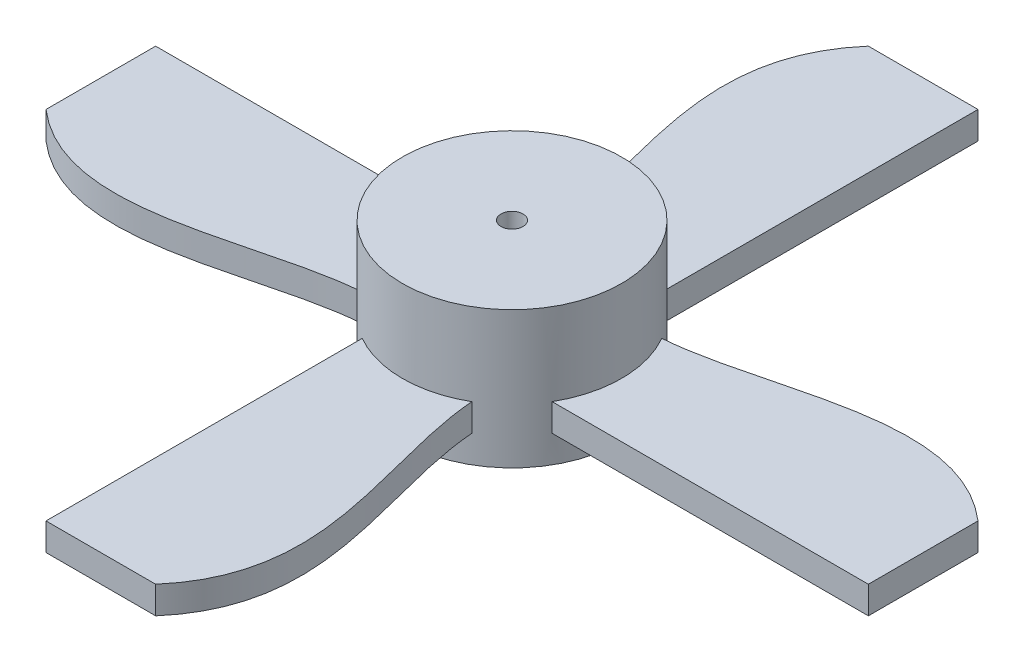
ISO-10303-21;
HEADER;
FILE_DESCRIPTION(('STEP AP214'),'2;1');
FILE_NAME('part.step','',(''),(''),'','','');
FILE_SCHEMA(('AUTOMOTIVE_DESIGN { 1 0 10303 214 1 1 1 1 }'));
ENDSEC;
DATA;
#1=APPLICATION_CONTEXT('core data for automotive mechanical design processes');
#2=APPLICATION_PROTOCOL_DEFINITION('international standard','automotive_design',2000,#1);
#3=PRODUCT_CONTEXT('',#1,'mechanical');
#4=PRODUCT('Part','Part','',(#3));
#5=PRODUCT_RELATED_PRODUCT_CATEGORY('part','',(#4));
#6=PRODUCT_DEFINITION_FORMATION('','',#4);
#7=PRODUCT_DEFINITION_CONTEXT('part definition',#1,'design');
#8=PRODUCT_DEFINITION('design','',#6,#7);
#9=PRODUCT_DEFINITION_SHAPE('','',#8);
#10=(LENGTH_UNIT() NAMED_UNIT(*) SI_UNIT(.MILLI.,.METRE.));
#11=(NAMED_UNIT(*) PLANE_ANGLE_UNIT() SI_UNIT($,.RADIAN.));
#12=(NAMED_UNIT(*) SI_UNIT($,.STERADIAN.) SOLID_ANGLE_UNIT());
#13=UNCERTAINTY_MEASURE_WITH_UNIT(LENGTH_MEASURE(1.E-05),#10,'distance_accuracy_value','');
#14=(GEOMETRIC_REPRESENTATION_CONTEXT(3) GLOBAL_UNCERTAINTY_ASSIGNED_CONTEXT((#13)) GLOBAL_UNIT_ASSIGNED_CONTEXT((#10,
#11,#12)) REPRESENTATION_CONTEXT('',''));
#15=CARTESIAN_POINT('',(0.,0.,0.));
#16=DIRECTION('',(0.,0.,1.));
#17=DIRECTION('',(1.,0.,0.));
#18=AXIS2_PLACEMENT_3D('',#15,#16,#17);
#19=CARTESIAN_POINT('',(0.,5.,0.));
#20=DIRECTION('',(0.,-1.,0.));
#21=DIRECTION('',(0.,0.,-1.));
#22=AXIS2_PLACEMENT_3D('',#19,#20,#21);
#23=CYLINDRICAL_SURFACE('',#22,4.);
#24=DIRECTION('',(0.,-1.,0.));
#25=VECTOR('',#24,1.);
#26=CARTESIAN_POINT('',(2.00000000000004,2.,-3.46410161513773));
#27=LINE('',#26,#25);
#28=CARTESIAN_POINT('',(2.00000000000004,2.,-3.46410161513773));
#29=VERTEX_POINT('',#28);
#30=CARTESIAN_POINT('',(2.00000000000004,1.,-3.46410161513773));
#31=VERTEX_POINT('',#30);
#32=EDGE_CURVE('E59',#29,#31,#27,.T.);
#33=ORIENTED_EDGE('',*,*,#32,.F.);
#34=CARTESIAN_POINT('',(0.,2.,0.));
#35=DIRECTION('',(0.,-1.,0.));
#36=DIRECTION('',(0.,0.,1.));
#37=AXIS2_PLACEMENT_3D('',#34,#35,#36);
#38=CIRCLE('',#37,4.);
#39=CARTESIAN_POINT('',(-2.,2.,-3.46410161513775));
#40=VERTEX_POINT('',#39);
#41=EDGE_CURVE('E54',#40,#29,#38,.T.);
#42=ORIENTED_EDGE('',*,*,#41,.F.);
#43=DIRECTION('',(0.,-1.,0.));
#44=VECTOR('',#43,1.);
#45=CARTESIAN_POINT('',(-2.,2.,-3.46410161513775));
#46=LINE('',#45,#44);
#47=CARTESIAN_POINT('',(-2.,1.,-3.46410161513775));
#48=VERTEX_POINT('',#47);
#49=EDGE_CURVE('E172',#40,#48,#46,.T.);
#50=ORIENTED_EDGE('',*,*,#49,.T.);
#51=CARTESIAN_POINT('',(0.,1.,0.));
#52=DIRECTION('',(0.,-1.,0.));
#53=DIRECTION('',(0.,0.,1.));
#54=AXIS2_PLACEMENT_3D('',#51,#52,#53);
#55=CIRCLE('',#54,4.);
#56=EDGE_CURVE('E450',#48,#31,#55,.T.);
#57=ORIENTED_EDGE('',*,*,#56,.T.);
#58=EDGE_LOOP('',(#33,#42,#50,#57));
#59=FACE_BOUND('',#58,.T.);
#60=DIRECTION('',(0.,-1.,0.));
#61=VECTOR('',#60,1.);
#62=CARTESIAN_POINT('',(-3.46410161513774,2.,-2.00000000000003));
#63=LINE('',#62,#61);
#64=CARTESIAN_POINT('',(-3.46410161513774,2.,-2.00000000000003));
#65=VERTEX_POINT('',#64);
#66=CARTESIAN_POINT('',(-3.46410161513774,1.,-2.00000000000003));
#67=VERTEX_POINT('',#66);
#68=EDGE_CURVE('E255',#65,#67,#63,.T.);
#69=ORIENTED_EDGE('',*,*,#68,.F.);
#70=CARTESIAN_POINT('',(0.,2.,0.));
#71=DIRECTION('',(0.,-1.,0.));
#72=DIRECTION('',(0.,0.,1.));
#73=AXIS2_PLACEMENT_3D('',#70,#71,#72);
#74=CIRCLE('',#73,4.);
#75=CARTESIAN_POINT('',(-3.46410161513775,2.,2.));
#76=VERTEX_POINT('',#75);
#77=EDGE_CURVE('E222',#76,#65,#74,.T.);
#78=ORIENTED_EDGE('',*,*,#77,.F.);
#79=DIRECTION('',(0.,-1.,0.));
#80=VECTOR('',#79,1.);
#81=CARTESIAN_POINT('',(-3.46410161513775,2.,2.));
#82=LINE('',#81,#80);
#83=CARTESIAN_POINT('',(-3.46410161513775,1.,2.));
#84=VERTEX_POINT('',#83);
#85=EDGE_CURVE('E259',#76,#84,#82,.T.);
#86=ORIENTED_EDGE('',*,*,#85,.T.);
#87=CARTESIAN_POINT('',(0.,1.,0.));
#88=DIRECTION('',(0.,-1.,0.));
#89=DIRECTION('',(0.,0.,1.));
#90=AXIS2_PLACEMENT_3D('',#87,#88,#89);
#91=CIRCLE('',#90,4.);
#92=EDGE_CURVE('E242',#84,#67,#91,.T.);
#93=ORIENTED_EDGE('',*,*,#92,.T.);
#94=EDGE_LOOP('',(#69,#78,#86,#93));
#95=FACE_BOUND('',#94,.T.);
#96=DIRECTION('',(0.,-1.,0.));
#97=VECTOR('',#96,1.);
#98=CARTESIAN_POINT('',(-2.00000000000001,2.,3.46410161513775));
#99=LINE('',#98,#97);
#100=CARTESIAN_POINT('',(-2.00000000000001,2.,3.46410161513775));
#101=VERTEX_POINT('',#100);
#102=CARTESIAN_POINT('',(-2.00000000000001,1.,3.46410161513775));
#103=VERTEX_POINT('',#102);
#104=EDGE_CURVE('E394',#101,#103,#99,.T.);
#105=ORIENTED_EDGE('',*,*,#104,.F.);
#106=CARTESIAN_POINT('',(0.,2.,0.));
#107=DIRECTION('',(0.,-1.,0.));
#108=DIRECTION('',(0.,0.,1.));
#109=AXIS2_PLACEMENT_3D('',#106,#107,#108);
#110=CIRCLE('',#109,4.);
#111=CARTESIAN_POINT('',(2.,2.,3.46410161513776));
#112=VERTEX_POINT('',#111);
#113=EDGE_CURVE('E278',#112,#101,#110,.T.);
#114=ORIENTED_EDGE('',*,*,#113,.F.);
#115=DIRECTION('',(0.,-1.,0.));
#116=VECTOR('',#115,1.);
#117=CARTESIAN_POINT('',(2.,2.,3.46410161513776));
#118=LINE('',#117,#116);
#119=CARTESIAN_POINT('',(2.,1.,3.46410161513776));
#120=VERTEX_POINT('',#119);
#121=EDGE_CURVE('E409',#112,#120,#118,.T.);
#122=ORIENTED_EDGE('',*,*,#121,.T.);
#123=CARTESIAN_POINT('',(0.,1.,0.));
#124=DIRECTION('',(0.,-1.,0.));
#125=DIRECTION('',(0.,0.,1.));
#126=AXIS2_PLACEMENT_3D('',#123,#124,#125);
#127=CIRCLE('',#126,4.);
#128=EDGE_CURVE('E423',#120,#103,#127,.T.);
#129=ORIENTED_EDGE('',*,*,#128,.T.);
#130=EDGE_LOOP('',(#105,#114,#122,#129));
#131=FACE_BOUND('',#130,.T.);
#132=DIRECTION('',(0.,-1.,0.));
#133=VECTOR('',#132,1.);
#134=CARTESIAN_POINT('',(3.46410161513775,2.,2.));
#135=LINE('',#134,#133);
#136=CARTESIAN_POINT('',(3.46410161513775,2.,2.));
#137=VERTEX_POINT('',#136);
#138=CARTESIAN_POINT('',(3.46410161513775,1.,2.));
#139=VERTEX_POINT('',#138);
#140=EDGE_CURVE('E358',#137,#139,#135,.T.);
#141=ORIENTED_EDGE('',*,*,#140,.F.);
#142=CARTESIAN_POINT('',(0.,2.,0.));
#143=DIRECTION('',(0.,-1.,0.));
#144=DIRECTION('',(0.,0.,1.));
#145=AXIS2_PLACEMENT_3D('',#142,#143,#144);
#146=CIRCLE('',#145,4.);
#147=CARTESIAN_POINT('',(3.46410161513776,2.,-2.));
#148=VERTEX_POINT('',#147);
#149=EDGE_CURVE('E322',#148,#137,#146,.T.);
#150=ORIENTED_EDGE('',*,*,#149,.F.);
#151=DIRECTION('',(0.,-1.,0.));
#152=VECTOR('',#151,1.);
#153=CARTESIAN_POINT('',(3.46410161513776,2.,-2.));
#154=LINE('',#153,#152);
#155=CARTESIAN_POINT('',(3.46410161513776,1.,-2.));
#156=VERTEX_POINT('',#155);
#157=EDGE_CURVE('E362',#148,#156,#154,.T.);
#158=ORIENTED_EDGE('',*,*,#157,.T.);
#159=CARTESIAN_POINT('',(0.,1.,0.));
#160=DIRECTION('',(0.,-1.,0.));
#161=DIRECTION('',(0.,0.,1.));
#162=AXIS2_PLACEMENT_3D('',#159,#160,#161);
#163=CIRCLE('',#162,4.);
#164=EDGE_CURVE('E345',#156,#139,#163,.T.);
#165=ORIENTED_EDGE('',*,*,#164,.T.);
#166=EDGE_LOOP('',(#141,#150,#158,#165));
#167=FACE_BOUND('',#166,.T.);
#168=CARTESIAN_POINT('',(0.,5.,0.));
#169=DIRECTION('',(0.,1.,0.));
#170=DIRECTION('',(0.,0.,1.));
#171=AXIS2_PLACEMENT_3D('',#168,#169,#170);
#172=CIRCLE('',#171,4.);
#173=CARTESIAN_POINT('',(0.,5.,4.));
#174=VERTEX_POINT('',#173);
#175=EDGE_CURVE('E11',#174,#174,#172,.T.);
#176=ORIENTED_EDGE('',*,*,#175,.F.);
#177=EDGE_LOOP('',(#176));
#178=FACE_BOUND('',#177,.T.);
#179=CARTESIAN_POINT('',(0.,0.,0.));
#180=DIRECTION('',(0.,1.,0.));
#181=DIRECTION('',(0.,0.,1.));
#182=AXIS2_PLACEMENT_3D('',#179,#180,#181);
#183=CIRCLE('',#182,4.);
#184=CARTESIAN_POINT('',(0.,0.,4.));
#185=VERTEX_POINT('',#184);
#186=EDGE_CURVE('E42',#185,#185,#183,.T.);
#187=ORIENTED_EDGE('',*,*,#186,.T.);
#188=EDGE_LOOP('',(#187));
#189=FACE_BOUND('',#188,.T.);
#190=ADVANCED_FACE('F39',(#59,#95,#131,#167,#178,#189),#23,.T.);
#191=CARTESIAN_POINT('',(0.,5.,0.));
#192=DIRECTION('',(0.,1.,0.));
#193=DIRECTION('',(0.,0.,1.));
#194=AXIS2_PLACEMENT_3D('',#191,#192,#193);
#195=PLANE('',#194);
#196=CARTESIAN_POINT('',(0.,5.,0.));
#197=DIRECTION('',(0.,1.,0.));
#198=DIRECTION('',(0.,0.,1.));
#199=AXIS2_PLACEMENT_3D('',#196,#197,#198);
#200=CIRCLE('',#199,0.4);
#201=CARTESIAN_POINT('',(0.,5.,0.4));
#202=VERTEX_POINT('',#201);
#203=EDGE_CURVE('E445',#202,#202,#200,.T.);
#204=ORIENTED_EDGE('',*,*,#203,.F.);
#205=EDGE_LOOP('',(#204));
#206=FACE_BOUND('',#205,.T.);
#207=ORIENTED_EDGE('',*,*,#175,.T.);
#208=EDGE_LOOP('',(#207));
#209=FACE_BOUND('',#208,.T.);
#210=ADVANCED_FACE('F378',(#206,#209),#195,.T.);
#211=CARTESIAN_POINT('',(0.,0.,0.));
#212=DIRECTION('',(0.,1.,0.));
#213=DIRECTION('',(0.,0.,1.));
#214=AXIS2_PLACEMENT_3D('',#211,#212,#213);
#215=PLANE('',#214);
#216=CARTESIAN_POINT('',(0.,0.,0.));
#217=DIRECTION('',(0.,1.,0.));
#218=DIRECTION('',(0.,0.,1.));
#219=AXIS2_PLACEMENT_3D('',#216,#217,#218);
#220=CIRCLE('',#219,0.4);
#221=CARTESIAN_POINT('',(0.,0.,0.4));
#222=VERTEX_POINT('',#221);
#223=EDGE_CURVE('E655',#222,#222,#220,.T.);
#224=ORIENTED_EDGE('',*,*,#223,.T.);
#225=EDGE_LOOP('',(#224));
#226=FACE_BOUND('',#225,.T.);
#227=ORIENTED_EDGE('',*,*,#186,.F.);
#228=EDGE_LOOP('',(#227));
#229=FACE_BOUND('',#228,.T.);
#230=ADVANCED_FACE('F376',(#226,#229),#215,.F.);
#231=CARTESIAN_POINT('',(15.,2.,-2.));
#232=DIRECTION('',(-1.,0.,0.));
#233=DIRECTION('',(0.,0.,1.));
#234=AXIS2_PLACEMENT_3D('',#231,#232,#233);
#235=PLANE('',#234);
#236=DIRECTION('',(0.,0.,-1.));
#237=VECTOR('',#236,1.);
#238=CARTESIAN_POINT('',(15.,1.,-2.));
#239=LINE('',#238,#237);
#240=CARTESIAN_POINT('',(15.,1.,2.));
#241=VERTEX_POINT('',#240);
#242=CARTESIAN_POINT('',(15.,1.,-2.));
#243=VERTEX_POINT('',#242);
#244=EDGE_CURVE('E335',#241,#243,#239,.T.);
#245=ORIENTED_EDGE('',*,*,#244,.T.);
#246=DIRECTION('',(0.,-1.,0.));
#247=VECTOR('',#246,1.);
#248=CARTESIAN_POINT('',(15.,2.,-2.));
#249=LINE('',#248,#247);
#250=CARTESIAN_POINT('',(15.,2.,-2.));
#251=VERTEX_POINT('',#250);
#252=EDGE_CURVE('E365',#251,#243,#249,.T.);
#253=ORIENTED_EDGE('',*,*,#252,.F.);
#254=DIRECTION('',(0.,0.,-1.));
#255=VECTOR('',#254,1.);
#256=CARTESIAN_POINT('',(15.,2.,0.));
#257=LINE('',#256,#255);
#258=CARTESIAN_POINT('',(15.,2.,2.));
#259=VERTEX_POINT('',#258);
#260=EDGE_CURVE('E323',#259,#251,#257,.T.);
#261=ORIENTED_EDGE('',*,*,#260,.F.);
#262=DIRECTION('',(0.,-1.,0.));
#263=VECTOR('',#262,1.);
#264=CARTESIAN_POINT('',(15.,2.,2.));
#265=LINE('',#264,#263);
#266=EDGE_CURVE('E334',#259,#241,#265,.T.);
#267=ORIENTED_EDGE('',*,*,#266,.T.);
#268=EDGE_LOOP('',(#245,#253,#261,#267));
#269=FACE_BOUND('',#268,.T.);
#270=ADVANCED_FACE('F311',(#269),#235,.F.);
#271=CARTESIAN_POINT('',(15.,2.,-2.));
#272=CARTESIAN_POINT('',(11.5493930592696,2.,-4.99537695920347));
#273=CARTESIAN_POINT('',(7.05991185852772,2.,-2.2618757054063));
#274=CARTESIAN_POINT('',(3.46410161513776,2.,-2.));
#275=B_SPLINE_CURVE_WITH_KNOTS('',3,(#271,#272,#273,#274),.UNSPECIFIED.,.F.,.F.,(4,4),(0.,1.),.UNSPECIFIED.);
#276=DIRECTION('',(0.,-1.,0.));
#277=VECTOR('',#276,1.);
#278=SURFACE_OF_LINEAR_EXTRUSION('',#275,#277);
#279=CARTESIAN_POINT('',(15.,1.,-2.));
#280=CARTESIAN_POINT('',(11.5493930592696,1.,-4.99537695920347));
#281=CARTESIAN_POINT('',(7.05991185852772,1.,-2.2618757054063));
#282=CARTESIAN_POINT('',(3.46410161513776,1.,-2.));
#283=B_SPLINE_CURVE_WITH_KNOTS('',3,(#279,#280,#281,#282),.UNSPECIFIED.,.F.,.F.,(4,4),(0.,1.),.UNSPECIFIED.);
#284=EDGE_CURVE('E338',#243,#156,#283,.T.);
#285=ORIENTED_EDGE('',*,*,#284,.T.);
#286=ORIENTED_EDGE('',*,*,#157,.F.);
#287=EDGE_CURVE('E314',#251,#148,#275,.T.);
#288=ORIENTED_EDGE('',*,*,#287,.F.);
#289=ORIENTED_EDGE('',*,*,#252,.T.);
#290=EDGE_LOOP('',(#285,#286,#288,#289));
#291=FACE_BOUND('',#290,.T.);
#292=ADVANCED_FACE('F306',(#291),#278,.F.);
#293=CARTESIAN_POINT('',(15.,2.,2.));
#294=DIRECTION('',(0.,0.,-1.));
#295=DIRECTION('',(-1.,0.,0.));
#296=AXIS2_PLACEMENT_3D('',#293,#294,#295);
#297=PLANE('',#296);
#298=DIRECTION('',(1.,0.,0.));
#299=VECTOR('',#298,1.);
#300=CARTESIAN_POINT('',(15.,1.,2.));
#301=LINE('',#300,#299);
#302=EDGE_CURVE('E351',#139,#241,#301,.T.);
#303=ORIENTED_EDGE('',*,*,#302,.T.);
#304=ORIENTED_EDGE('',*,*,#266,.F.);
#305=DIRECTION('',(1.,0.,0.));
#306=VECTOR('',#305,1.);
#307=CARTESIAN_POINT('',(15.,2.,2.));
#308=LINE('',#307,#306);
#309=EDGE_CURVE('E331',#137,#259,#308,.T.);
#310=ORIENTED_EDGE('',*,*,#309,.F.);
#311=ORIENTED_EDGE('',*,*,#140,.T.);
#312=EDGE_LOOP('',(#303,#304,#310,#311));
#313=FACE_BOUND('',#312,.T.);
#314=ADVANCED_FACE('F299',(#313),#297,.F.);
#315=CARTESIAN_POINT('',(0.,2.,0.));
#316=DIRECTION('',(0.,1.,0.));
#317=DIRECTION('',(0.,0.,1.));
#318=AXIS2_PLACEMENT_3D('',#315,#316,#317);
#319=PLANE('',#318);
#320=ORIENTED_EDGE('',*,*,#260,.T.);
#321=ORIENTED_EDGE('',*,*,#287,.T.);
#322=ORIENTED_EDGE('',*,*,#149,.T.);
#323=ORIENTED_EDGE('',*,*,#309,.T.);
#324=EDGE_LOOP('',(#320,#321,#322,#323));
#325=FACE_BOUND('',#324,.T.);
#326=ADVANCED_FACE('F296',(#325),#319,.T.);
#327=CARTESIAN_POINT('',(0.,1.,0.));
#328=DIRECTION('',(0.,1.,0.));
#329=DIRECTION('',(0.,0.,1.));
#330=AXIS2_PLACEMENT_3D('',#327,#328,#329);
#331=PLANE('',#330);
#332=ORIENTED_EDGE('',*,*,#244,.F.);
#333=ORIENTED_EDGE('',*,*,#302,.F.);
#334=ORIENTED_EDGE('',*,*,#164,.F.);
#335=ORIENTED_EDGE('',*,*,#284,.F.);
#336=EDGE_LOOP('',(#332,#333,#334,#335));
#337=FACE_BOUND('',#336,.T.);
#338=ADVANCED_FACE('F294',(#337),#331,.F.);
#339=CARTESIAN_POINT('',(1.99999999999995,2.,15.));
#340=DIRECTION('',(0.,0.,-1.));
#341=DIRECTION('',(-1.,0.,0.));
#342=AXIS2_PLACEMENT_3D('',#339,#340,#341);
#343=PLANE('',#342);
#344=DIRECTION('',(1.,0.,0.));
#345=VECTOR('',#344,1.);
#346=CARTESIAN_POINT('',(1.99999999999995,1.,15.));
#347=LINE('',#346,#345);
#348=CARTESIAN_POINT('',(-2.00000000000005,1.,15.));
#349=VERTEX_POINT('',#348);
#350=CARTESIAN_POINT('',(1.99999999999995,1.,15.));
#351=VERTEX_POINT('',#350);
#352=EDGE_CURVE('E266',#349,#351,#347,.T.);
#353=ORIENTED_EDGE('',*,*,#352,.T.);
#354=DIRECTION('',(0.,-1.,0.));
#355=VECTOR('',#354,1.);
#356=CARTESIAN_POINT('',(1.99999999999995,2.,15.));
#357=LINE('',#356,#355);
#358=CARTESIAN_POINT('',(1.99999999999995,2.,15.));
#359=VERTEX_POINT('',#358);
#360=EDGE_CURVE('E339',#359,#351,#357,.T.);
#361=ORIENTED_EDGE('',*,*,#360,.F.);
#362=DIRECTION('',(1.,0.,0.));
#363=VECTOR('',#362,1.);
#364=CARTESIAN_POINT('',(0.,2.,15.));
#365=LINE('',#364,#363);
#366=CARTESIAN_POINT('',(-2.00000000000005,2.,15.));
#367=VERTEX_POINT('',#366);
#368=EDGE_CURVE('E267',#367,#359,#365,.T.);
#369=ORIENTED_EDGE('',*,*,#368,.F.);
#370=DIRECTION('',(0.,-1.,0.));
#371=VECTOR('',#370,1.);
#372=CARTESIAN_POINT('',(-2.00000000000005,2.,15.));
#373=LINE('',#372,#371);
#374=EDGE_CURVE('E413',#367,#349,#373,.T.);
#375=ORIENTED_EDGE('',*,*,#374,.T.);
#376=EDGE_LOOP('',(#353,#361,#369,#375));
#377=FACE_BOUND('',#376,.T.);
#378=ADVANCED_FACE('F289',(#377),#343,.F.);
#379=CARTESIAN_POINT('',(2.,2.,15.));
#380=CARTESIAN_POINT('',(4.99537695920339,2.,11.5493930592695));
#381=CARTESIAN_POINT('',(2.26187570540629,2.,7.05991185852775));
#382=CARTESIAN_POINT('',(2.,2.,3.46410161513776));
#383=B_SPLINE_CURVE_WITH_KNOTS('',3,(#379,#380,#381,#382),.UNSPECIFIED.,.F.,.F.,(4,4),(0.,1.),.UNSPECIFIED.);
#384=DIRECTION('',(0.,-1.,0.));
#385=VECTOR('',#384,1.);
#386=SURFACE_OF_LINEAR_EXTRUSION('',#383,#385);
#387=CARTESIAN_POINT('',(2.,1.,15.));
#388=CARTESIAN_POINT('',(4.99537695920339,1.,11.5493930592695));
#389=CARTESIAN_POINT('',(2.26187570540629,1.,7.05991185852775));
#390=CARTESIAN_POINT('',(2.,1.,3.46410161513776));
#391=B_SPLINE_CURVE_WITH_KNOTS('',3,(#387,#388,#389,#390),.UNSPECIFIED.,.F.,.F.,(4,4),(0.,1.),.UNSPECIFIED.);
#392=EDGE_CURVE('E426',#351,#120,#391,.T.);
#393=ORIENTED_EDGE('',*,*,#392,.T.);
#394=ORIENTED_EDGE('',*,*,#121,.F.);
#395=EDGE_CURVE('E270',#359,#112,#383,.T.);
#396=ORIENTED_EDGE('',*,*,#395,.F.);
#397=ORIENTED_EDGE('',*,*,#360,.T.);
#398=EDGE_LOOP('',(#393,#394,#396,#397));
#399=FACE_BOUND('',#398,.T.);
#400=ADVANCED_FACE('F284',(#399),#386,.F.);
#401=CARTESIAN_POINT('',(-2.00000000000005,2.,15.));
#402=DIRECTION('',(1.,0.,0.));
#403=DIRECTION('',(0.,0.,-1.));
#404=AXIS2_PLACEMENT_3D('',#401,#402,#403);
#405=PLANE('',#404);
#406=DIRECTION('',(0.,0.,1.));
#407=VECTOR('',#406,1.);
#408=CARTESIAN_POINT('',(-2.00000000000005,1.,15.));
#409=LINE('',#408,#407);
#410=EDGE_CURVE('E271',#103,#349,#409,.T.);
#411=ORIENTED_EDGE('',*,*,#410,.T.);
#412=ORIENTED_EDGE('',*,*,#374,.F.);
#413=DIRECTION('',(0.,0.,1.));
#414=VECTOR('',#413,1.);
#415=CARTESIAN_POINT('',(-2.00000000000005,2.,15.));
#416=LINE('',#415,#414);
#417=EDGE_CURVE('E417',#101,#367,#416,.T.);
#418=ORIENTED_EDGE('',*,*,#417,.F.);
#419=ORIENTED_EDGE('',*,*,#104,.T.);
#420=EDGE_LOOP('',(#411,#412,#418,#419));
#421=FACE_BOUND('',#420,.T.);
#422=ADVANCED_FACE('F288',(#421),#405,.F.);
#423=CARTESIAN_POINT('',(0.,2.,0.));
#424=DIRECTION('',(0.,1.,0.));
#425=DIRECTION('',(0.,0.,1.));
#426=AXIS2_PLACEMENT_3D('',#423,#424,#425);
#427=PLANE('',#426);
#428=ORIENTED_EDGE('',*,*,#368,.T.);
#429=ORIENTED_EDGE('',*,*,#395,.T.);
#430=ORIENTED_EDGE('',*,*,#113,.T.);
#431=ORIENTED_EDGE('',*,*,#417,.T.);
#432=EDGE_LOOP('',(#428,#429,#430,#431));
#433=FACE_BOUND('',#432,.T.);
#434=ADVANCED_FACE('F514',(#433),#427,.T.);
#435=CARTESIAN_POINT('',(0.,1.,0.));
#436=DIRECTION('',(0.,1.,0.));
#437=DIRECTION('',(0.,0.,1.));
#438=AXIS2_PLACEMENT_3D('',#435,#436,#437);
#439=PLANE('',#438);
#440=ORIENTED_EDGE('',*,*,#352,.F.);
#441=ORIENTED_EDGE('',*,*,#410,.F.);
#442=ORIENTED_EDGE('',*,*,#128,.F.);
#443=ORIENTED_EDGE('',*,*,#392,.F.);
#444=EDGE_LOOP('',(#440,#441,#442,#443));
#445=FACE_BOUND('',#444,.T.);
#446=ADVANCED_FACE('F507',(#445),#439,.F.);
#447=CARTESIAN_POINT('',(-15.,2.,1.9999999999999));
#448=DIRECTION('',(1.,0.,0.));
#449=DIRECTION('',(0.,0.,-1.));
#450=AXIS2_PLACEMENT_3D('',#447,#448,#449);
#451=PLANE('',#450);
#452=DIRECTION('',(0.,0.,1.));
#453=VECTOR('',#452,1.);
#454=CARTESIAN_POINT('',(-15.,1.,1.9999999999999));
#455=LINE('',#454,#453);
#456=CARTESIAN_POINT('',(-15.,1.,-2.0000000000001));
#457=VERTEX_POINT('',#456);
#458=CARTESIAN_POINT('',(-15.,1.,1.9999999999999));
#459=VERTEX_POINT('',#458);
#460=EDGE_CURVE('E171',#457,#459,#455,.T.);
#461=ORIENTED_EDGE('',*,*,#460,.T.);
#462=DIRECTION('',(0.,-1.,0.));
#463=VECTOR('',#462,1.);
#464=CARTESIAN_POINT('',(-15.,2.,1.9999999999999));
#465=LINE('',#464,#463);
#466=CARTESIAN_POINT('',(-15.,2.,1.9999999999999));
#467=VERTEX_POINT('',#466);
#468=EDGE_CURVE('E262',#467,#459,#465,.T.);
#469=ORIENTED_EDGE('',*,*,#468,.F.);
#470=DIRECTION('',(0.,0.,1.));
#471=VECTOR('',#470,1.);
#472=CARTESIAN_POINT('',(-15.,2.,-1.04744440165294E-13));
#473=LINE('',#472,#471);
#474=CARTESIAN_POINT('',(-15.,2.,-2.0000000000001));
#475=VERTEX_POINT('',#474);
#476=EDGE_CURVE('E223',#475,#467,#473,.T.);
#477=ORIENTED_EDGE('',*,*,#476,.F.);
#478=DIRECTION('',(0.,-1.,0.));
#479=VECTOR('',#478,1.);
#480=CARTESIAN_POINT('',(-15.,2.,-2.0000000000001));
#481=LINE('',#480,#479);
#482=EDGE_CURVE('E233',#475,#457,#481,.T.);
#483=ORIENTED_EDGE('',*,*,#482,.T.);
#484=EDGE_LOOP('',(#461,#469,#477,#483));
#485=FACE_BOUND('',#484,.T.);
#486=ADVANCED_FACE('F211',(#485),#451,.F.);
#487=CARTESIAN_POINT('',(-15.,2.,2.));
#488=CARTESIAN_POINT('',(-11.5493930592695,2.,4.9953769592033));
#489=CARTESIAN_POINT('',(-7.05991185852776,2.,2.2618757054063));
#490=CARTESIAN_POINT('',(-3.46410161513775,2.,2.));
#491=B_SPLINE_CURVE_WITH_KNOTS('',3,(#487,#488,#489,#490),.UNSPECIFIED.,.F.,.F.,(4,4),(0.,1.),.UNSPECIFIED.);
#492=DIRECTION('',(0.,-1.,0.));
#493=VECTOR('',#492,1.);
#494=SURFACE_OF_LINEAR_EXTRUSION('',#491,#493);
#495=CARTESIAN_POINT('',(-15.,1.,2.));
#496=CARTESIAN_POINT('',(-11.5493930592695,1.,4.9953769592033));
#497=CARTESIAN_POINT('',(-7.05991185852776,1.,2.2618757054063));
#498=CARTESIAN_POINT('',(-3.46410161513775,1.,2.));
#499=B_SPLINE_CURVE_WITH_KNOTS('',3,(#495,#496,#497,#498),.UNSPECIFIED.,.F.,.F.,(4,4),(0.,1.),.UNSPECIFIED.);
#500=EDGE_CURVE('E236',#459,#84,#499,.T.);
#501=ORIENTED_EDGE('',*,*,#500,.T.);
#502=ORIENTED_EDGE('',*,*,#85,.F.);
#503=EDGE_CURVE('E214',#467,#76,#491,.T.);
#504=ORIENTED_EDGE('',*,*,#503,.F.);
#505=ORIENTED_EDGE('',*,*,#468,.T.);
#506=EDGE_LOOP('',(#501,#502,#504,#505));
#507=FACE_BOUND('',#506,.T.);
#508=ADVANCED_FACE('F206',(#507),#494,.F.);
#509=CARTESIAN_POINT('',(-15.,2.,-2.0000000000001));
#510=DIRECTION('',(0.,0.,1.));
#511=DIRECTION('',(1.,0.,0.));
#512=AXIS2_PLACEMENT_3D('',#509,#510,#511);
#513=PLANE('',#512);
#514=DIRECTION('',(-1.,0.,0.));
#515=VECTOR('',#514,1.);
#516=CARTESIAN_POINT('',(-15.,1.,-2.0000000000001));
#517=LINE('',#516,#515);
#518=EDGE_CURVE('E248',#67,#457,#517,.T.);
#519=ORIENTED_EDGE('',*,*,#518,.T.);
#520=ORIENTED_EDGE('',*,*,#482,.F.);
#521=DIRECTION('',(-1.,0.,0.));
#522=VECTOR('',#521,1.);
#523=CARTESIAN_POINT('',(-15.,2.,-2.0000000000001));
#524=LINE('',#523,#522);
#525=EDGE_CURVE('E230',#65,#475,#524,.T.);
#526=ORIENTED_EDGE('',*,*,#525,.F.);
#527=ORIENTED_EDGE('',*,*,#68,.T.);
#528=EDGE_LOOP('',(#519,#520,#526,#527));
#529=FACE_BOUND('',#528,.T.);
#530=ADVANCED_FACE('F199',(#529),#513,.F.);
#531=CARTESIAN_POINT('',(0.,2.,0.));
#532=DIRECTION('',(0.,1.,0.));
#533=DIRECTION('',(0.,0.,1.));
#534=AXIS2_PLACEMENT_3D('',#531,#532,#533);
#535=PLANE('',#534);
#536=ORIENTED_EDGE('',*,*,#476,.T.);
#537=ORIENTED_EDGE('',*,*,#503,.T.);
#538=ORIENTED_EDGE('',*,*,#77,.T.);
#539=ORIENTED_EDGE('',*,*,#525,.T.);
#540=EDGE_LOOP('',(#536,#537,#538,#539));
#541=FACE_BOUND('',#540,.T.);
#542=ADVANCED_FACE('F196',(#541),#535,.T.);
#543=CARTESIAN_POINT('',(0.,1.,0.));
#544=DIRECTION('',(0.,1.,0.));
#545=DIRECTION('',(0.,0.,1.));
#546=AXIS2_PLACEMENT_3D('',#543,#544,#545);
#547=PLANE('',#546);
#548=ORIENTED_EDGE('',*,*,#460,.F.);
#549=ORIENTED_EDGE('',*,*,#518,.F.);
#550=ORIENTED_EDGE('',*,*,#92,.F.);
#551=ORIENTED_EDGE('',*,*,#500,.F.);
#552=EDGE_LOOP('',(#548,#549,#550,#551));
#553=FACE_BOUND('',#552,.T.);
#554=ADVANCED_FACE('F195',(#553),#547,.F.);
#555=CARTESIAN_POINT('',(-1.99999999999984,2.,-15.));
#556=DIRECTION('',(0.,0.,1.));
#557=DIRECTION('',(1.,0.,0.));
#558=AXIS2_PLACEMENT_3D('',#555,#556,#557);
#559=PLANE('',#558);
#560=DIRECTION('',(-1.,0.,0.));
#561=VECTOR('',#560,1.);
#562=CARTESIAN_POINT('',(-1.99999999999984,1.,-15.));
#563=LINE('',#562,#561);
#564=CARTESIAN_POINT('',(2.00000000000016,1.,-15.));
#565=VERTEX_POINT('',#564);
#566=CARTESIAN_POINT('',(-1.99999999999984,1.,-15.));
#567=VERTEX_POINT('',#566);
#568=EDGE_CURVE('E166',#565,#567,#563,.T.);
#569=ORIENTED_EDGE('',*,*,#568,.T.);
#570=DIRECTION('',(0.,-1.,0.));
#571=VECTOR('',#570,1.);
#572=CARTESIAN_POINT('',(-1.99999999999984,2.,-15.));
#573=LINE('',#572,#571);
#574=CARTESIAN_POINT('',(-1.99999999999984,2.,-15.));
#575=VERTEX_POINT('',#574);
#576=EDGE_CURVE('E164',#575,#567,#573,.T.);
#577=ORIENTED_EDGE('',*,*,#576,.F.);
#578=DIRECTION('',(-1.,0.,0.));
#579=VECTOR('',#578,1.);
#580=CARTESIAN_POINT('',(1.57116660247941E-13,2.,-15.));
#581=LINE('',#580,#579);
#582=CARTESIAN_POINT('',(2.00000000000016,2.,-15.));
#583=VERTEX_POINT('',#582);
#584=EDGE_CURVE('E149',#583,#575,#581,.T.);
#585=ORIENTED_EDGE('',*,*,#584,.F.);
#586=DIRECTION('',(0.,-1.,0.));
#587=VECTOR('',#586,1.);
#588=CARTESIAN_POINT('',(2.00000000000016,2.,-15.));
#589=LINE('',#588,#587);
#590=EDGE_CURVE('E437',#583,#565,#589,.T.);
#591=ORIENTED_EDGE('',*,*,#590,.T.);
#592=EDGE_LOOP('',(#569,#577,#585,#591));
#593=FACE_BOUND('',#592,.T.);
#594=ADVANCED_FACE('F165',(#593),#559,.F.);
#595=CARTESIAN_POINT('',(-2.,2.,-15.));
#596=CARTESIAN_POINT('',(-4.99537695920321,2.,-11.5493930592695));
#597=CARTESIAN_POINT('',(-2.26187570540629,2.,-7.05991185852778));
#598=CARTESIAN_POINT('',(-2.,2.,-3.46410161513775));
#599=B_SPLINE_CURVE_WITH_KNOTS('',3,(#595,#596,#597,#598),.UNSPECIFIED.,.F.,.F.,(4,4),(0.,1.),.UNSPECIFIED.);
#600=DIRECTION('',(0.,-1.,0.));
#601=VECTOR('',#600,1.);
#602=SURFACE_OF_LINEAR_EXTRUSION('',#599,#601);
#603=CARTESIAN_POINT('',(-2.,1.,-15.));
#604=CARTESIAN_POINT('',(-4.99537695920321,1.,-11.5493930592695));
#605=CARTESIAN_POINT('',(-2.26187570540629,1.,-7.05991185852778));
#606=CARTESIAN_POINT('',(-2.,1.,-3.46410161513775));
#607=B_SPLINE_CURVE_WITH_KNOTS('',3,(#603,#604,#605,#606),.UNSPECIFIED.,.F.,.F.,(4,4),(0.,1.),.UNSPECIFIED.);
#608=EDGE_CURVE('E444',#567,#48,#607,.T.);
#609=ORIENTED_EDGE('',*,*,#608,.T.);
#610=ORIENTED_EDGE('',*,*,#49,.F.);
#611=EDGE_CURVE('E153',#575,#40,#599,.T.);
#612=ORIENTED_EDGE('',*,*,#611,.F.);
#613=ORIENTED_EDGE('',*,*,#576,.T.);
#614=EDGE_LOOP('',(#609,#610,#612,#613));
#615=FACE_BOUND('',#614,.T.);
#616=ADVANCED_FACE('F174',(#615),#602,.F.);
#617=CARTESIAN_POINT('',(2.00000000000016,2.,-15.));
#618=DIRECTION('',(-1.,0.,0.));
#619=DIRECTION('',(0.,0.,1.));
#620=AXIS2_PLACEMENT_3D('',#617,#618,#619);
#621=PLANE('',#620);
#622=DIRECTION('',(0.,0.,-1.));
#623=VECTOR('',#622,1.);
#624=CARTESIAN_POINT('',(2.00000000000016,1.,-15.));
#625=LINE('',#624,#623);
#626=EDGE_CURVE('E161',#31,#565,#625,.T.);
#627=ORIENTED_EDGE('',*,*,#626,.T.);
#628=ORIENTED_EDGE('',*,*,#590,.F.);
#629=DIRECTION('',(0.,0.,-1.));
#630=VECTOR('',#629,1.);
#631=CARTESIAN_POINT('',(2.00000000000016,2.,-15.));
#632=LINE('',#631,#630);
#633=EDGE_CURVE('E156',#29,#583,#632,.T.);
#634=ORIENTED_EDGE('',*,*,#633,.F.);
#635=ORIENTED_EDGE('',*,*,#32,.T.);
#636=EDGE_LOOP('',(#627,#628,#634,#635));
#637=FACE_BOUND('',#636,.T.);
#638=ADVANCED_FACE('F191',(#637),#621,.F.);
#639=CARTESIAN_POINT('',(0.,2.,0.));
#640=DIRECTION('',(0.,1.,0.));
#641=DIRECTION('',(0.,0.,1.));
#642=AXIS2_PLACEMENT_3D('',#639,#640,#641);
#643=PLANE('',#642);
#644=ORIENTED_EDGE('',*,*,#584,.T.);
#645=ORIENTED_EDGE('',*,*,#611,.T.);
#646=ORIENTED_EDGE('',*,*,#41,.T.);
#647=ORIENTED_EDGE('',*,*,#633,.T.);
#648=EDGE_LOOP('',(#644,#645,#646,#647));
#649=FACE_BOUND('',#648,.T.);
#650=ADVANCED_FACE('F151',(#649),#643,.T.);
#651=CARTESIAN_POINT('',(0.,1.,0.));
#652=DIRECTION('',(0.,1.,0.));
#653=DIRECTION('',(0.,0.,1.));
#654=AXIS2_PLACEMENT_3D('',#651,#652,#653);
#655=PLANE('',#654);
#656=ORIENTED_EDGE('',*,*,#568,.F.);
#657=ORIENTED_EDGE('',*,*,#626,.F.);
#658=ORIENTED_EDGE('',*,*,#56,.F.);
#659=ORIENTED_EDGE('',*,*,#608,.F.);
#660=EDGE_LOOP('',(#656,#657,#658,#659));
#661=FACE_BOUND('',#660,.T.);
#662=ADVANCED_FACE('F462',(#661),#655,.F.);
#663=CARTESIAN_POINT('',(0.,0.,0.));
#664=DIRECTION('',(0.,1.,0.));
#665=DIRECTION('',(0.,0.,1.));
#666=AXIS2_PLACEMENT_3D('',#663,#664,#665);
#667=CYLINDRICAL_SURFACE('',#666,0.4);
#668=ORIENTED_EDGE('',*,*,#203,.T.);
#669=EDGE_LOOP('',(#668));
#670=FACE_BOUND('',#669,.T.);
#671=ORIENTED_EDGE('',*,*,#223,.F.);
#672=EDGE_LOOP('',(#671));
#673=FACE_BOUND('',#672,.T.);
#674=ADVANCED_FACE('F464',(#670,#673),#667,.F.);
#675=CLOSED_SHELL('',(#190,#210,#230,#270,#292,#314,#326,#338,#378,#400,#422,#434,#446,#486,
#508,#530,#542,#554,#594,#616,#638,#650,#662,#674));
#676=MANIFOLD_SOLID_BREP('B2',#675);
#677=ADVANCED_BREP_SHAPE_REPRESENTATION('',(#18,#676),#14);
#678=SHAPE_DEFINITION_REPRESENTATION(#9,#677);
ENDSEC;
END-ISO-10303-21;
